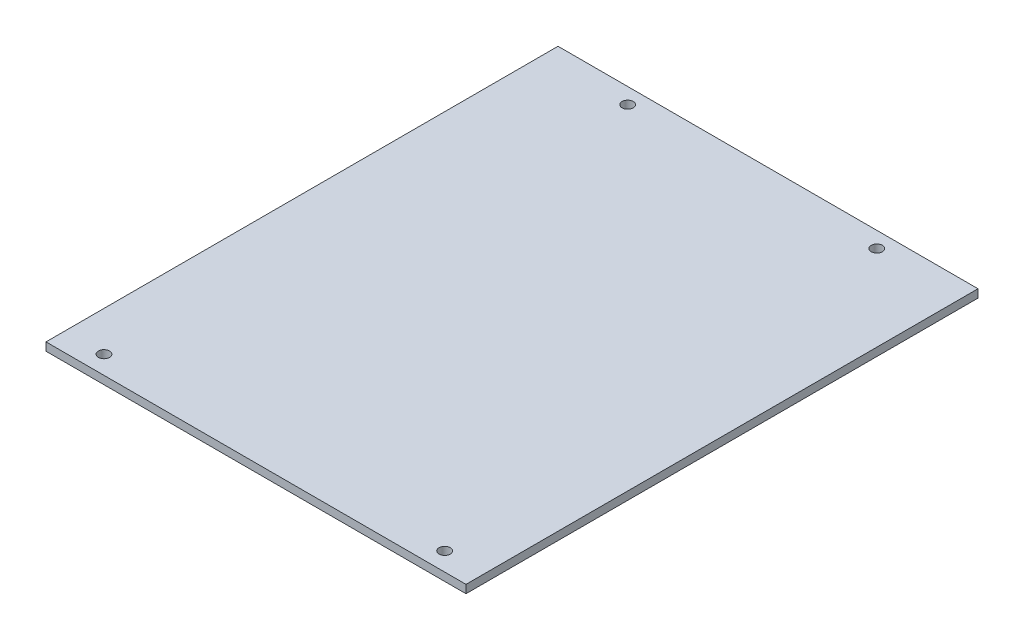
ISO-10303-21;
HEADER;
FILE_DESCRIPTION(('STEP AP214'),'2;1');
FILE_NAME('part.step','',(''),(''),'','','');
FILE_SCHEMA(('AUTOMOTIVE_DESIGN { 1 0 10303 214 1 1 1 1 }'));
ENDSEC;
DATA;
#1=APPLICATION_CONTEXT('core data for automotive mechanical design processes');
#2=APPLICATION_PROTOCOL_DEFINITION('international standard','automotive_design',2000,#1);
#3=PRODUCT_CONTEXT('',#1,'mechanical');
#4=PRODUCT('Part','Part','',(#3));
#5=PRODUCT_RELATED_PRODUCT_CATEGORY('part','',(#4));
#6=PRODUCT_DEFINITION_FORMATION('','',#4);
#7=PRODUCT_DEFINITION_CONTEXT('part definition',#1,'design');
#8=PRODUCT_DEFINITION('design','',#6,#7);
#9=PRODUCT_DEFINITION_SHAPE('','',#8);
#10=(LENGTH_UNIT() NAMED_UNIT(*) SI_UNIT(.MILLI.,.METRE.));
#11=(NAMED_UNIT(*) PLANE_ANGLE_UNIT() SI_UNIT($,.RADIAN.));
#12=(NAMED_UNIT(*) SI_UNIT($,.STERADIAN.) SOLID_ANGLE_UNIT());
#13=UNCERTAINTY_MEASURE_WITH_UNIT(LENGTH_MEASURE(1.E-05),#10,'distance_accuracy_value','');
#14=(GEOMETRIC_REPRESENTATION_CONTEXT(3) GLOBAL_UNCERTAINTY_ASSIGNED_CONTEXT((#13)) GLOBAL_UNIT_ASSIGNED_CONTEXT((#10,
#11,#12)) REPRESENTATION_CONTEXT('',''));
#15=CARTESIAN_POINT('',(0.,0.,0.));
#16=DIRECTION('',(0.,0.,1.));
#17=DIRECTION('',(1.,0.,0.));
#18=AXIS2_PLACEMENT_3D('',#15,#16,#17);
#19=CARTESIAN_POINT('',(-17.76,1.6,-32.5625473621053));
#20=DIRECTION('',(0.,0.,-1.));
#21=DIRECTION('',(-1.,0.,0.));
#22=AXIS2_PLACEMENT_3D('',#19,#20,#21);
#23=PLANE('',#22);
#24=DIRECTION('',(0.,-1.,0.));
#25=VECTOR('',#24,1.);
#26=CARTESIAN_POINT('',(65.04,1.6,-32.5625473621053));
#27=LINE('',#26,#25);
#28=CARTESIAN_POINT('',(65.04,1.6,-32.5625473621053));
#29=VERTEX_POINT('',#28);
#30=CARTESIAN_POINT('',(65.04,0.,-32.5625473621053));
#31=VERTEX_POINT('',#30);
#32=EDGE_CURVE('E83',#29,#31,#27,.T.);
#33=ORIENTED_EDGE('',*,*,#32,.T.);
#34=DIRECTION('',(1.,0.,0.));
#35=VECTOR('',#34,1.);
#36=CARTESIAN_POINT('',(-17.76,0.,-32.5625473621053));
#37=LINE('',#36,#35);
#38=CARTESIAN_POINT('',(-17.56,0.,-32.5625473621053));
#39=VERTEX_POINT('',#38);
#40=EDGE_CURVE('E129',#39,#31,#37,.T.);
#41=ORIENTED_EDGE('',*,*,#40,.F.);
#42=DIRECTION('',(0.,-1.,0.));
#43=VECTOR('',#42,1.);
#44=CARTESIAN_POINT('',(-17.56,1.6,-32.5625473621053));
#45=LINE('',#44,#43);
#46=CARTESIAN_POINT('',(-17.56,1.6,-32.5625473621053));
#47=VERTEX_POINT('',#46);
#48=EDGE_CURVE('E64',#47,#39,#45,.T.);
#49=ORIENTED_EDGE('',*,*,#48,.F.);
#50=DIRECTION('',(1.,0.,0.));
#51=VECTOR('',#50,1.);
#52=CARTESIAN_POINT('',(-17.76,1.6,-32.5625473621053));
#53=LINE('',#52,#51);
#54=EDGE_CURVE('E48',#47,#29,#53,.T.);
#55=ORIENTED_EDGE('',*,*,#54,.T.);
#56=EDGE_LOOP('',(#33,#41,#49,#55));
#57=FACE_BOUND('',#56,.T.);
#58=ADVANCED_FACE('F40',(#57),#23,.T.);
#59=CARTESIAN_POINT('',(65.24,1.6,68.1374526378947));
#60=DIRECTION('',(0.,0.,1.));
#61=DIRECTION('',(1.,0.,0.));
#62=AXIS2_PLACEMENT_3D('',#59,#60,#61);
#63=PLANE('',#62);
#64=DIRECTION('',(0.,-1.,0.));
#65=VECTOR('',#64,1.);
#66=CARTESIAN_POINT('',(65.04,1.6,68.1374526378947));
#67=LINE('',#66,#65);
#68=CARTESIAN_POINT('',(65.04,1.6,68.1374526378947));
#69=VERTEX_POINT('',#68);
#70=CARTESIAN_POINT('',(65.04,0.,68.1374526378947));
#71=VERTEX_POINT('',#70);
#72=EDGE_CURVE('E56',#69,#71,#67,.T.);
#73=ORIENTED_EDGE('',*,*,#72,.F.);
#74=DIRECTION('',(-1.,0.,0.));
#75=VECTOR('',#74,1.);
#76=CARTESIAN_POINT('',(65.24,1.6,68.1374526378947));
#77=LINE('',#76,#75);
#78=CARTESIAN_POINT('',(-17.56,1.6,68.1374526378947));
#79=VERTEX_POINT('',#78);
#80=EDGE_CURVE('E11',#69,#79,#77,.T.);
#81=ORIENTED_EDGE('',*,*,#80,.T.);
#82=DIRECTION('',(0.,-1.,0.));
#83=VECTOR('',#82,1.);
#84=CARTESIAN_POINT('',(-17.56,1.6,68.1374526378947));
#85=LINE('',#84,#83);
#86=CARTESIAN_POINT('',(-17.56,0.,68.1374526378947));
#87=VERTEX_POINT('',#86);
#88=EDGE_CURVE('E102',#79,#87,#85,.T.);
#89=ORIENTED_EDGE('',*,*,#88,.T.);
#90=DIRECTION('',(-1.,0.,0.));
#91=VECTOR('',#90,1.);
#92=CARTESIAN_POINT('',(65.24,0.,68.1374526378947));
#93=LINE('',#92,#91);
#94=EDGE_CURVE('E95',#71,#87,#93,.T.);
#95=ORIENTED_EDGE('',*,*,#94,.F.);
#96=EDGE_LOOP('',(#73,#81,#89,#95));
#97=FACE_BOUND('',#96,.T.);
#98=ADVANCED_FACE('F92',(#97),#63,.T.);
#99=CARTESIAN_POINT('',(0.,1.6,0.));
#100=DIRECTION('',(0.,-1.,0.));
#101=DIRECTION('',(0.,0.,-1.));
#102=AXIS2_PLACEMENT_3D('',#99,#100,#101);
#103=PLANE('',#102);
#104=CARTESIAN_POINT('',(-9.75999999999999,1.6,64.5374526378947));
#105=DIRECTION('',(0.,1.,0.));
#106=DIRECTION('',(0.,0.,1.));
#107=AXIS2_PLACEMENT_3D('',#104,#105,#106);
#108=CIRCLE('',#107,1.1);
#109=CARTESIAN_POINT('',(-9.75999999999999,1.6,65.6374526378947));
#110=VERTEX_POINT('',#109);
#111=EDGE_CURVE('E107',#110,#110,#108,.T.);
#112=ORIENTED_EDGE('',*,*,#111,.F.);
#113=EDGE_LOOP('',(#112));
#114=FACE_BOUND('',#113,.T.);
#115=CARTESIAN_POINT('',(57.24,1.6,64.5374526378947));
#116=DIRECTION('',(0.,1.,0.));
#117=DIRECTION('',(0.,0.,1.));
#118=AXIS2_PLACEMENT_3D('',#115,#116,#117);
#119=CIRCLE('',#118,1.1);
#120=CARTESIAN_POINT('',(57.24,1.6,65.6374526378947));
#121=VERTEX_POINT('',#120);
#122=EDGE_CURVE('E111',#121,#121,#119,.T.);
#123=ORIENTED_EDGE('',*,*,#122,.F.);
#124=EDGE_LOOP('',(#123));
#125=FACE_BOUND('',#124,.T.);
#126=CARTESIAN_POINT('',(-0.759999999999986,1.6,-29.4625473621053));
#127=DIRECTION('',(0.,1.,0.));
#128=DIRECTION('',(0.,0.,1.));
#129=AXIS2_PLACEMENT_3D('',#126,#127,#128);
#130=CIRCLE('',#129,1.1);
#131=CARTESIAN_POINT('',(-0.759999999999986,1.6,-28.3625473621053));
#132=VERTEX_POINT('',#131);
#133=EDGE_CURVE('E117',#132,#132,#130,.T.);
#134=ORIENTED_EDGE('',*,*,#133,.F.);
#135=EDGE_LOOP('',(#134));
#136=FACE_BOUND('',#135,.T.);
#137=CARTESIAN_POINT('',(48.24,1.6,-29.4625473621053));
#138=DIRECTION('',(0.,1.,0.));
#139=DIRECTION('',(0.,0.,1.));
#140=AXIS2_PLACEMENT_3D('',#137,#138,#139);
#141=CIRCLE('',#140,1.1);
#142=CARTESIAN_POINT('',(48.24,1.6,-28.3625473621053));
#143=VERTEX_POINT('',#142);
#144=EDGE_CURVE('E123',#143,#143,#141,.T.);
#145=ORIENTED_EDGE('',*,*,#144,.F.);
#146=EDGE_LOOP('',(#145));
#147=FACE_BOUND('',#146,.T.);
#148=ORIENTED_EDGE('',*,*,#80,.F.);
#149=DIRECTION('',(0.,0.,-1.));
#150=VECTOR('',#149,1.);
#151=CARTESIAN_POINT('',(65.04,1.6,68.1374526378947));
#152=LINE('',#151,#150);
#153=EDGE_CURVE('E80',#69,#29,#152,.T.);
#154=ORIENTED_EDGE('',*,*,#153,.T.);
#155=ORIENTED_EDGE('',*,*,#54,.F.);
#156=DIRECTION('',(0.,0.,1.));
#157=VECTOR('',#156,1.);
#158=CARTESIAN_POINT('',(-17.56,1.6,68.1374526378947));
#159=LINE('',#158,#157);
#160=EDGE_CURVE('E99',#47,#79,#159,.T.);
#161=ORIENTED_EDGE('',*,*,#160,.T.);
#162=EDGE_LOOP('',(#148,#154,#155,#161));
#163=FACE_BOUND('',#162,.T.);
#164=ADVANCED_FACE('F98',(#114,#125,#136,#147,#163),#103,.F.);
#165=CARTESIAN_POINT('',(0.,0.,0.));
#166=DIRECTION('',(0.,-1.,0.));
#167=DIRECTION('',(0.,0.,-1.));
#168=AXIS2_PLACEMENT_3D('',#165,#166,#167);
#169=PLANE('',#168);
#170=DIRECTION('',(0.,0.,-1.));
#171=VECTOR('',#170,1.);
#172=CARTESIAN_POINT('',(65.04,0.,68.1374526378947));
#173=LINE('',#172,#171);
#174=EDGE_CURVE('E88',#71,#31,#173,.T.);
#175=ORIENTED_EDGE('',*,*,#174,.F.);
#176=ORIENTED_EDGE('',*,*,#94,.T.);
#177=DIRECTION('',(0.,0.,1.));
#178=VECTOR('',#177,1.);
#179=CARTESIAN_POINT('',(-17.56,0.,68.1374526378947));
#180=LINE('',#179,#178);
#181=EDGE_CURVE('E100',#39,#87,#180,.T.);
#182=ORIENTED_EDGE('',*,*,#181,.F.);
#183=ORIENTED_EDGE('',*,*,#40,.T.);
#184=EDGE_LOOP('',(#175,#176,#182,#183));
#185=FACE_BOUND('',#184,.T.);
#186=CARTESIAN_POINT('',(-9.75999999999999,0.,64.5374526378947));
#187=DIRECTION('',(0.,-1.,0.));
#188=DIRECTION('',(0.,0.,-1.));
#189=AXIS2_PLACEMENT_3D('',#186,#187,#188);
#190=CIRCLE('',#189,1.1);
#191=CARTESIAN_POINT('',(-9.75999999999999,0.,63.4374526378947));
#192=VERTEX_POINT('',#191);
#193=EDGE_CURVE('E43',#192,#192,#190,.T.);
#194=ORIENTED_EDGE('',*,*,#193,.F.);
#195=EDGE_LOOP('',(#194));
#196=FACE_BOUND('',#195,.T.);
#197=CARTESIAN_POINT('',(57.24,0.,64.5374526378947));
#198=DIRECTION('',(0.,-1.,0.));
#199=DIRECTION('',(0.,0.,-1.));
#200=AXIS2_PLACEMENT_3D('',#197,#198,#199);
#201=CIRCLE('',#200,1.1);
#202=CARTESIAN_POINT('',(57.24,0.,63.4374526378947));
#203=VERTEX_POINT('',#202);
#204=EDGE_CURVE('E114',#203,#203,#201,.T.);
#205=ORIENTED_EDGE('',*,*,#204,.F.);
#206=EDGE_LOOP('',(#205));
#207=FACE_BOUND('',#206,.T.);
#208=CARTESIAN_POINT('',(-0.759999999999986,0.,-29.4625473621053));
#209=DIRECTION('',(0.,1.,0.));
#210=DIRECTION('',(0.,0.,1.));
#211=AXIS2_PLACEMENT_3D('',#208,#209,#210);
#212=CIRCLE('',#211,1.1);
#213=CARTESIAN_POINT('',(-0.759999999999986,0.,-28.3625473621053));
#214=VERTEX_POINT('',#213);
#215=EDGE_CURVE('E120',#214,#214,#212,.T.);
#216=ORIENTED_EDGE('',*,*,#215,.T.);
#217=EDGE_LOOP('',(#216));
#218=FACE_BOUND('',#217,.T.);
#219=CARTESIAN_POINT('',(48.24,0.,-29.4625473621053));
#220=DIRECTION('',(0.,1.,0.));
#221=DIRECTION('',(0.,0.,1.));
#222=AXIS2_PLACEMENT_3D('',#219,#220,#221);
#223=CIRCLE('',#222,1.1);
#224=CARTESIAN_POINT('',(48.24,0.,-28.3625473621053));
#225=VERTEX_POINT('',#224);
#226=EDGE_CURVE('E126',#225,#225,#223,.T.);
#227=ORIENTED_EDGE('',*,*,#226,.T.);
#228=EDGE_LOOP('',(#227));
#229=FACE_BOUND('',#228,.T.);
#230=ADVANCED_FACE('F133',(#185,#196,#207,#218,#229),#169,.T.);
#231=CARTESIAN_POINT('',(48.24,1.6,-29.4625473621053));
#232=DIRECTION('',(0.,1.,0.));
#233=DIRECTION('',(0.,0.,1.));
#234=AXIS2_PLACEMENT_3D('',#231,#232,#233);
#235=CYLINDRICAL_SURFACE('',#234,1.1);
#236=ORIENTED_EDGE('',*,*,#226,.F.);
#237=EDGE_LOOP('',(#236));
#238=FACE_BOUND('',#237,.T.);
#239=ORIENTED_EDGE('',*,*,#144,.T.);
#240=EDGE_LOOP('',(#239));
#241=FACE_BOUND('',#240,.T.);
#242=ADVANCED_FACE('F161',(#238,#241),#235,.F.);
#243=CARTESIAN_POINT('',(-0.759999999999986,1.6,-29.4625473621053));
#244=DIRECTION('',(0.,1.,0.));
#245=DIRECTION('',(0.,0.,1.));
#246=AXIS2_PLACEMENT_3D('',#243,#244,#245);
#247=CYLINDRICAL_SURFACE('',#246,1.1);
#248=ORIENTED_EDGE('',*,*,#215,.F.);
#249=EDGE_LOOP('',(#248));
#250=FACE_BOUND('',#249,.T.);
#251=ORIENTED_EDGE('',*,*,#133,.T.);
#252=EDGE_LOOP('',(#251));
#253=FACE_BOUND('',#252,.T.);
#254=ADVANCED_FACE('F165',(#250,#253),#247,.F.);
#255=CARTESIAN_POINT('',(57.24,1.6,64.5374526378947));
#256=DIRECTION('',(0.,1.,0.));
#257=DIRECTION('',(0.,0.,1.));
#258=AXIS2_PLACEMENT_3D('',#255,#256,#257);
#259=CYLINDRICAL_SURFACE('',#258,1.1);
#260=ORIENTED_EDGE('',*,*,#204,.T.);
#261=EDGE_LOOP('',(#260));
#262=FACE_BOUND('',#261,.T.);
#263=ORIENTED_EDGE('',*,*,#122,.T.);
#264=EDGE_LOOP('',(#263));
#265=FACE_BOUND('',#264,.T.);
#266=ADVANCED_FACE('F145',(#262,#265),#259,.F.);
#267=CARTESIAN_POINT('',(-9.75999999999999,1.6,64.5374526378947));
#268=DIRECTION('',(0.,1.,0.));
#269=DIRECTION('',(0.,0.,1.));
#270=AXIS2_PLACEMENT_3D('',#267,#268,#269);
#271=CYLINDRICAL_SURFACE('',#270,1.1);
#272=ORIENTED_EDGE('',*,*,#193,.T.);
#273=EDGE_LOOP('',(#272));
#274=FACE_BOUND('',#273,.T.);
#275=ORIENTED_EDGE('',*,*,#111,.T.);
#276=EDGE_LOOP('',(#275));
#277=FACE_BOUND('',#276,.T.);
#278=ADVANCED_FACE('F138',(#274,#277),#271,.F.);
#279=CARTESIAN_POINT('',(-17.56,1.6,68.1374526378947));
#280=DIRECTION('',(1.,0.,0.));
#281=DIRECTION('',(0.,0.,-1.));
#282=AXIS2_PLACEMENT_3D('',#279,#280,#281);
#283=PLANE('',#282);
#284=ORIENTED_EDGE('',*,*,#181,.T.);
#285=ORIENTED_EDGE('',*,*,#88,.F.);
#286=ORIENTED_EDGE('',*,*,#160,.F.);
#287=ORIENTED_EDGE('',*,*,#48,.T.);
#288=EDGE_LOOP('',(#284,#285,#286,#287));
#289=FACE_BOUND('',#288,.T.);
#290=ADVANCED_FACE('F136',(#289),#283,.F.);
#291=CARTESIAN_POINT('',(65.04,1.6,68.1374526378947));
#292=DIRECTION('',(-1.,0.,0.));
#293=DIRECTION('',(0.,0.,1.));
#294=AXIS2_PLACEMENT_3D('',#291,#292,#293);
#295=PLANE('',#294);
#296=ORIENTED_EDGE('',*,*,#174,.T.);
#297=ORIENTED_EDGE('',*,*,#32,.F.);
#298=ORIENTED_EDGE('',*,*,#153,.F.);
#299=ORIENTED_EDGE('',*,*,#72,.T.);
#300=EDGE_LOOP('',(#296,#297,#298,#299));
#301=FACE_BOUND('',#300,.T.);
#302=ADVANCED_FACE('F81',(#301),#295,.F.);
#303=CLOSED_SHELL('',(#58,#98,#164,#230,#242,#254,#266,#278,#290,#302));
#304=MANIFOLD_SOLID_BREP('B2',#303);
#305=ADVANCED_BREP_SHAPE_REPRESENTATION('',(#18,#304),#14);
#306=SHAPE_DEFINITION_REPRESENTATION(#9,#305);
ENDSEC;
END-ISO-10303-21;
